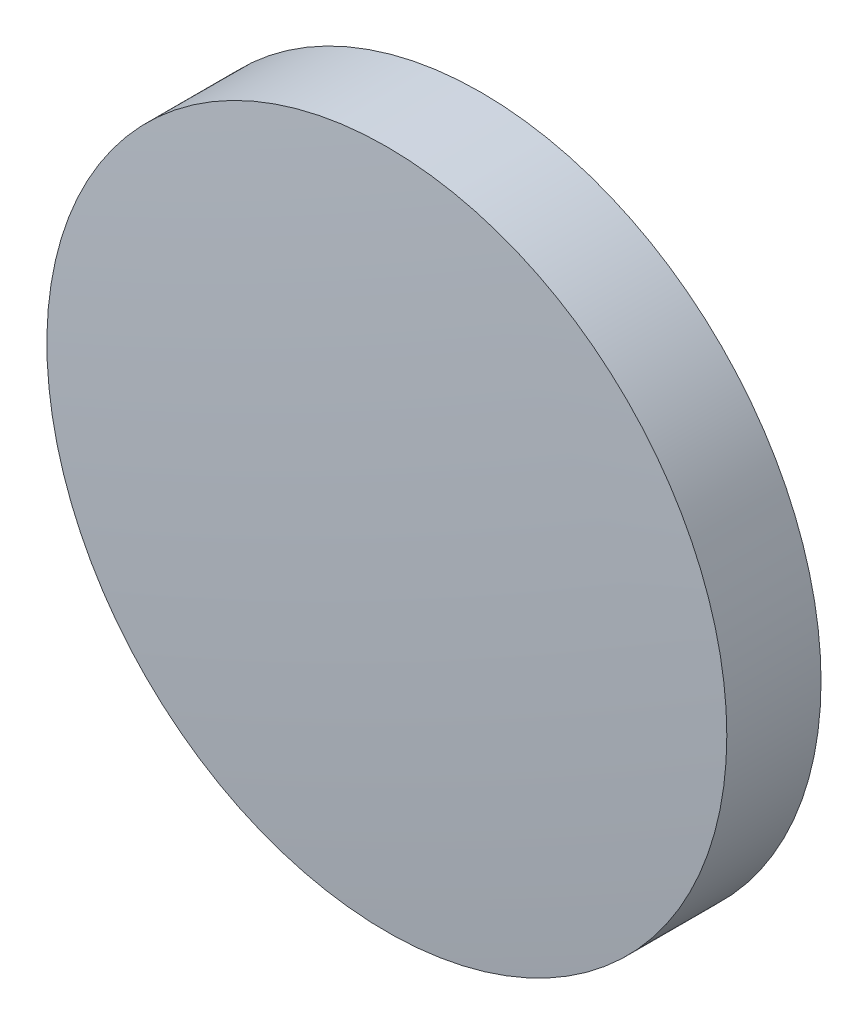
ISO-10303-21;
HEADER;
FILE_DESCRIPTION(('STEP AP214'),'2;1');
FILE_NAME('part.step','',(''),(''),'','','');
FILE_SCHEMA(('AUTOMOTIVE_DESIGN { 1 0 10303 214 1 1 1 1 }'));
ENDSEC;
DATA;
#1=APPLICATION_CONTEXT('core data for automotive mechanical design processes');
#2=APPLICATION_PROTOCOL_DEFINITION('international standard','automotive_design',2000,#1);
#3=PRODUCT_CONTEXT('',#1,'mechanical');
#4=PRODUCT('Part','Part','',(#3));
#5=PRODUCT_RELATED_PRODUCT_CATEGORY('part','',(#4));
#6=PRODUCT_DEFINITION_FORMATION('','',#4);
#7=PRODUCT_DEFINITION_CONTEXT('part definition',#1,'design');
#8=PRODUCT_DEFINITION('design','',#6,#7);
#9=PRODUCT_DEFINITION_SHAPE('','',#8);
#10=(LENGTH_UNIT() NAMED_UNIT(*) SI_UNIT(.MILLI.,.METRE.));
#11=(NAMED_UNIT(*) PLANE_ANGLE_UNIT() SI_UNIT($,.RADIAN.));
#12=(NAMED_UNIT(*) SI_UNIT($,.STERADIAN.) SOLID_ANGLE_UNIT());
#13=UNCERTAINTY_MEASURE_WITH_UNIT(LENGTH_MEASURE(1.E-05),#10,'distance_accuracy_value','');
#14=(GEOMETRIC_REPRESENTATION_CONTEXT(3) GLOBAL_UNCERTAINTY_ASSIGNED_CONTEXT((#13)) GLOBAL_UNIT_ASSIGNED_CONTEXT((#10,
#11,#12)) REPRESENTATION_CONTEXT('',''));
#15=CARTESIAN_POINT('',(0.,0.,0.));
#16=DIRECTION('',(0.,0.,1.));
#17=DIRECTION('',(1.,0.,0.));
#18=AXIS2_PLACEMENT_3D('',#15,#16,#17);
#19=CARTESIAN_POINT('',(0.,0.,-90.6));
#20=DIRECTION('',(0.,0.,1.));
#21=DIRECTION('',(0.,1.,0.));
#22=AXIS2_PLACEMENT_3D('',#19,#20,#21);
#23=SPHERICAL_SURFACE('',#22,91.7);
#24=CARTESIAN_POINT('',(0.,0.,0.879874835944108));
#25=DIRECTION('',(0.,0.,1.));
#26=DIRECTION('',(1.,0.,0.));
#27=AXIS2_PLACEMENT_3D('',#24,#25,#26);
#28=CIRCLE('',#27,6.35);
#29=CARTESIAN_POINT('',(6.35,0.,0.879874835944108));
#30=VERTEX_POINT('',#29);
#31=EDGE_CURVE('E10',#30,#30,#28,.T.);
#32=ORIENTED_EDGE('',*,*,#31,.T.);
#33=EDGE_LOOP('',(#32));
#34=FACE_BOUND('',#33,.T.);
#35=ADVANCED_FACE('F28',(#34),#23,.T.);
#36=CARTESIAN_POINT('',(0.,0.,1.1));
#37=DIRECTION('',(0.,0.,1.));
#38=DIRECTION('',(1.,0.,0.));
#39=AXIS2_PLACEMENT_3D('',#36,#37,#38);
#40=CYLINDRICAL_SURFACE('',#39,6.35);
#41=ORIENTED_EDGE('',*,*,#31,.F.);
#42=EDGE_LOOP('',(#41));
#43=FACE_BOUND('',#42,.T.);
#44=CARTESIAN_POINT('',(0.,0.,-0.879874835944122));
#45=DIRECTION('',(0.,0.,1.));
#46=DIRECTION('',(1.,0.,0.));
#47=AXIS2_PLACEMENT_3D('',#44,#45,#46);
#48=CIRCLE('',#47,6.35);
#49=CARTESIAN_POINT('',(6.35,0.,-0.879874835944122));
#50=VERTEX_POINT('',#49);
#51=EDGE_CURVE('E34',#50,#50,#48,.T.);
#52=ORIENTED_EDGE('',*,*,#51,.T.);
#53=EDGE_LOOP('',(#52));
#54=FACE_BOUND('',#53,.T.);
#55=ADVANCED_FACE('F40',(#43,#54),#40,.T.);
#56=CARTESIAN_POINT('',(0.,0.,90.6));
#57=DIRECTION('',(0.,0.,1.));
#58=DIRECTION('',(0.,1.,0.));
#59=AXIS2_PLACEMENT_3D('',#56,#57,#58);
#60=SPHERICAL_SURFACE('',#59,91.7);
#61=ORIENTED_EDGE('',*,*,#51,.F.);
#62=EDGE_LOOP('',(#61));
#63=FACE_BOUND('',#62,.T.);
#64=ADVANCED_FACE('F42',(#63),#60,.T.);
#65=CLOSED_SHELL('',(#35,#55,#64));
#66=MANIFOLD_SOLID_BREP('B2',#65);
#67=ADVANCED_BREP_SHAPE_REPRESENTATION('',(#18,#66),#14);
#68=SHAPE_DEFINITION_REPRESENTATION(#9,#67);
ENDSEC;
END-ISO-10303-21;
